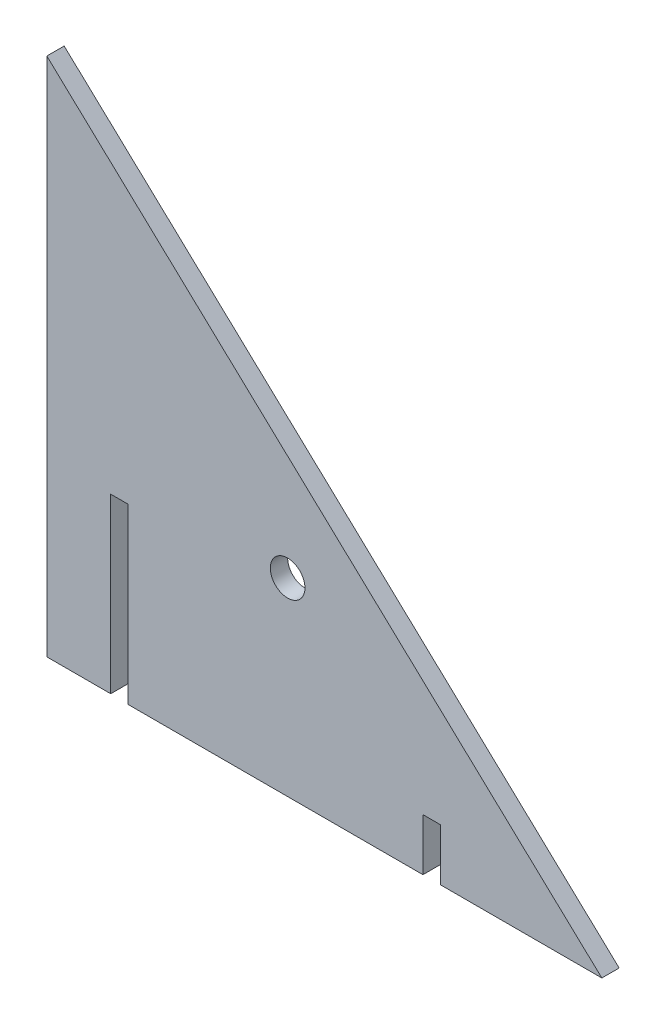
ISO-10303-21;
HEADER;
FILE_DESCRIPTION(('STEP AP214'),'2;1');
FILE_NAME('part.step','',(''),(''),'','','');
FILE_SCHEMA(('AUTOMOTIVE_DESIGN { 1 0 10303 214 1 1 1 1 }'));
ENDSEC;
DATA;
#1=APPLICATION_CONTEXT('core data for automotive mechanical design processes');
#2=APPLICATION_PROTOCOL_DEFINITION('international standard','automotive_design',2000,#1);
#3=PRODUCT_CONTEXT('',#1,'mechanical');
#4=PRODUCT('Part','Part','',(#3));
#5=PRODUCT_RELATED_PRODUCT_CATEGORY('part','',(#4));
#6=PRODUCT_DEFINITION_FORMATION('','',#4);
#7=PRODUCT_DEFINITION_CONTEXT('part definition',#1,'design');
#8=PRODUCT_DEFINITION('design','',#6,#7);
#9=PRODUCT_DEFINITION_SHAPE('','',#8);
#10=(LENGTH_UNIT() NAMED_UNIT(*) SI_UNIT(.MILLI.,.METRE.));
#11=(NAMED_UNIT(*) PLANE_ANGLE_UNIT() SI_UNIT($,.RADIAN.));
#12=(NAMED_UNIT(*) SI_UNIT($,.STERADIAN.) SOLID_ANGLE_UNIT());
#13=UNCERTAINTY_MEASURE_WITH_UNIT(LENGTH_MEASURE(1.E-05),#10,'distance_accuracy_value','');
#14=(GEOMETRIC_REPRESENTATION_CONTEXT(3) GLOBAL_UNCERTAINTY_ASSIGNED_CONTEXT((#13)) GLOBAL_UNIT_ASSIGNED_CONTEXT((#10,
#11,#12)) REPRESENTATION_CONTEXT('',''));
#15=CARTESIAN_POINT('',(0.,0.,0.));
#16=DIRECTION('',(0.,0.,1.));
#17=DIRECTION('',(1.,0.,0.));
#18=AXIS2_PLACEMENT_3D('',#15,#16,#17);
#19=CARTESIAN_POINT('',(0.,502.62579108452,76.2));
#20=DIRECTION('',(0.,1.,0.));
#21=DIRECTION('',(0.,0.,1.));
#22=AXIS2_PLACEMENT_3D('',#19,#20,#21);
#23=PLANE('',#22);
#24=DIRECTION('',(1.,0.,0.));
#25=VECTOR('',#24,1.);
#26=CARTESIAN_POINT('',(0.,502.62579108452,63.5));
#27=LINE('',#26,#25);
#28=CARTESIAN_POINT('',(2235.2,502.62579108452,63.5));
#29=VERTEX_POINT('',#28);
#30=CARTESIAN_POINT('',(2247.9,502.62579108452,63.5));
#31=VERTEX_POINT('',#30);
#32=EDGE_CURVE('E169',#29,#31,#27,.T.);
#33=ORIENTED_EDGE('',*,*,#32,.T.);
#34=DIRECTION('',(0.,0.,-1.));
#35=VECTOR('',#34,1.);
#36=CARTESIAN_POINT('',(2247.9,502.62579108452,76.2));
#37=LINE('',#36,#35);
#38=CARTESIAN_POINT('',(2247.9,502.62579108452,76.2));
#39=VERTEX_POINT('',#38);
#40=EDGE_CURVE('E151',#39,#31,#37,.T.);
#41=ORIENTED_EDGE('',*,*,#40,.F.);
#42=DIRECTION('',(1.,0.,0.));
#43=VECTOR('',#42,1.);
#44=CARTESIAN_POINT('',(0.,502.62579108452,76.2));
#45=LINE('',#44,#43);
#46=CARTESIAN_POINT('',(2235.2,502.62579108452,76.2));
#47=VERTEX_POINT('',#46);
#48=EDGE_CURVE('E197',#47,#39,#45,.T.);
#49=ORIENTED_EDGE('',*,*,#48,.F.);
#50=DIRECTION('',(0.,0.,-1.));
#51=VECTOR('',#50,1.);
#52=CARTESIAN_POINT('',(2235.2,502.62579108452,76.2));
#53=LINE('',#52,#51);
#54=EDGE_CURVE('E154',#47,#29,#53,.T.);
#55=ORIENTED_EDGE('',*,*,#54,.T.);
#56=EDGE_LOOP('',(#33,#41,#49,#55));
#57=FACE_BOUND('',#56,.T.);
#58=ADVANCED_FACE('F45',(#57),#23,.F.);
#59=CARTESIAN_POINT('',(2247.9,0.,76.2));
#60=DIRECTION('',(1.,0.,0.));
#61=DIRECTION('',(0.,0.,-1.));
#62=AXIS2_PLACEMENT_3D('',#59,#60,#61);
#63=PLANE('',#62);
#64=DIRECTION('',(0.,-1.,0.));
#65=VECTOR('',#64,1.);
#66=CARTESIAN_POINT('',(2247.9,0.,63.5));
#67=LINE('',#66,#65);
#68=CARTESIAN_POINT('',(2247.9,375.62579108452,63.5));
#69=VERTEX_POINT('',#68);
#70=EDGE_CURVE('E67',#31,#69,#67,.T.);
#71=ORIENTED_EDGE('',*,*,#70,.T.);
#72=DIRECTION('',(0.,0.,-1.));
#73=VECTOR('',#72,1.);
#74=CARTESIAN_POINT('',(2247.9,375.62579108452,76.2));
#75=LINE('',#74,#73);
#76=CARTESIAN_POINT('',(2247.9,375.62579108452,76.2));
#77=VERTEX_POINT('',#76);
#78=EDGE_CURVE('E148',#77,#69,#75,.T.);
#79=ORIENTED_EDGE('',*,*,#78,.F.);
#80=DIRECTION('',(0.,-1.,0.));
#81=VECTOR('',#80,1.);
#82=CARTESIAN_POINT('',(2247.9,0.,76.2));
#83=LINE('',#82,#81);
#84=EDGE_CURVE('E108',#39,#77,#83,.T.);
#85=ORIENTED_EDGE('',*,*,#84,.F.);
#86=ORIENTED_EDGE('',*,*,#40,.T.);
#87=EDGE_LOOP('',(#71,#79,#85,#86));
#88=FACE_BOUND('',#87,.T.);
#89=ADVANCED_FACE('F147',(#88),#63,.F.);
#90=CARTESIAN_POINT('',(0.,375.62579108452,76.2));
#91=DIRECTION('',(0.,1.,0.));
#92=DIRECTION('',(0.,0.,1.));
#93=AXIS2_PLACEMENT_3D('',#90,#91,#92);
#94=PLANE('',#93);
#95=DIRECTION('',(1.,0.,0.));
#96=VECTOR('',#95,1.);
#97=CARTESIAN_POINT('',(0.,375.62579108452,63.5));
#98=LINE('',#97,#96);
#99=CARTESIAN_POINT('',(2463.8,375.62579108452,63.5));
#100=VERTEX_POINT('',#99);
#101=EDGE_CURVE('E144',#69,#100,#98,.T.);
#102=ORIENTED_EDGE('',*,*,#101,.T.);
#103=DIRECTION('',(0.,0.,-1.));
#104=VECTOR('',#103,1.);
#105=CARTESIAN_POINT('',(2463.8,375.62579108452,76.2));
#106=LINE('',#105,#104);
#107=CARTESIAN_POINT('',(2463.8,375.62579108452,76.2));
#108=VERTEX_POINT('',#107);
#109=EDGE_CURVE('E233',#108,#100,#106,.T.);
#110=ORIENTED_EDGE('',*,*,#109,.F.);
#111=DIRECTION('',(1.,0.,0.));
#112=VECTOR('',#111,1.);
#113=CARTESIAN_POINT('',(0.,375.62579108452,76.2));
#114=LINE('',#113,#112);
#115=EDGE_CURVE('E157',#77,#108,#114,.T.);
#116=ORIENTED_EDGE('',*,*,#115,.F.);
#117=ORIENTED_EDGE('',*,*,#78,.T.);
#118=EDGE_LOOP('',(#102,#110,#116,#117));
#119=FACE_BOUND('',#118,.T.);
#120=ADVANCED_FACE('F156',(#119),#94,.F.);
#121=CARTESIAN_POINT('',(2463.8,0.,76.2));
#122=DIRECTION('',(-1.,0.,0.));
#123=DIRECTION('',(0.,0.,1.));
#124=AXIS2_PLACEMENT_3D('',#121,#122,#123);
#125=PLANE('',#124);
#126=DIRECTION('',(0.,1.,0.));
#127=VECTOR('',#126,1.);
#128=CARTESIAN_POINT('',(2463.8,0.,63.5));
#129=LINE('',#128,#127);
#130=CARTESIAN_POINT('',(2463.8,413.72579108452,63.5));
#131=VERTEX_POINT('',#130);
#132=EDGE_CURVE('E158',#100,#131,#129,.T.);
#133=ORIENTED_EDGE('',*,*,#132,.T.);
#134=DIRECTION('',(0.,0.,-1.));
#135=VECTOR('',#134,1.);
#136=CARTESIAN_POINT('',(2463.8,413.72579108452,76.2));
#137=LINE('',#136,#135);
#138=CARTESIAN_POINT('',(2463.8,413.72579108452,76.2));
#139=VERTEX_POINT('',#138);
#140=EDGE_CURVE('E231',#139,#131,#137,.T.);
#141=ORIENTED_EDGE('',*,*,#140,.F.);
#142=DIRECTION('',(0.,1.,0.));
#143=VECTOR('',#142,1.);
#144=CARTESIAN_POINT('',(2463.8,0.,76.2));
#145=LINE('',#144,#143);
#146=EDGE_CURVE('E193',#108,#139,#145,.T.);
#147=ORIENTED_EDGE('',*,*,#146,.F.);
#148=ORIENTED_EDGE('',*,*,#109,.T.);
#149=EDGE_LOOP('',(#133,#141,#147,#148));
#150=FACE_BOUND('',#149,.T.);
#151=ADVANCED_FACE('F270',(#150),#125,.F.);
#152=CARTESIAN_POINT('',(0.,413.72579108452,76.2));
#153=DIRECTION('',(0.,1.,0.));
#154=DIRECTION('',(0.,0.,1.));
#155=AXIS2_PLACEMENT_3D('',#152,#153,#154);
#156=PLANE('',#155);
#157=DIRECTION('',(1.,0.,0.));
#158=VECTOR('',#157,1.);
#159=CARTESIAN_POINT('',(0.,413.72579108452,63.5));
#160=LINE('',#159,#158);
#161=CARTESIAN_POINT('',(2476.5,413.72579108452,63.5));
#162=VERTEX_POINT('',#161);
#163=EDGE_CURVE('E232',#131,#162,#160,.T.);
#164=ORIENTED_EDGE('',*,*,#163,.T.);
#165=DIRECTION('',(0.,0.,-1.));
#166=VECTOR('',#165,1.);
#167=CARTESIAN_POINT('',(2476.5,413.72579108452,76.2));
#168=LINE('',#167,#166);
#169=CARTESIAN_POINT('',(2476.5,413.72579108452,76.2));
#170=VERTEX_POINT('',#169);
#171=EDGE_CURVE('E229',#170,#162,#168,.T.);
#172=ORIENTED_EDGE('',*,*,#171,.F.);
#173=DIRECTION('',(1.,0.,0.));
#174=VECTOR('',#173,1.);
#175=CARTESIAN_POINT('',(0.,413.72579108452,76.2));
#176=LINE('',#175,#174);
#177=EDGE_CURVE('E191',#139,#170,#176,.T.);
#178=ORIENTED_EDGE('',*,*,#177,.F.);
#179=ORIENTED_EDGE('',*,*,#140,.T.);
#180=EDGE_LOOP('',(#164,#172,#178,#179));
#181=FACE_BOUND('',#180,.T.);
#182=ADVANCED_FACE('F268',(#181),#156,.F.);
#183=CARTESIAN_POINT('',(2476.5,0.,76.2));
#184=DIRECTION('',(1.,0.,0.));
#185=DIRECTION('',(0.,0.,-1.));
#186=AXIS2_PLACEMENT_3D('',#183,#184,#185);
#187=PLANE('',#186);
#188=DIRECTION('',(0.,-1.,0.));
#189=VECTOR('',#188,1.);
#190=CARTESIAN_POINT('',(2476.5,0.,63.5));
#191=LINE('',#190,#189);
#192=CARTESIAN_POINT('',(2476.5,375.62579108452,63.5));
#193=VERTEX_POINT('',#192);
#194=EDGE_CURVE('E230',#162,#193,#191,.T.);
#195=ORIENTED_EDGE('',*,*,#194,.T.);
#196=DIRECTION('',(0.,0.,-1.));
#197=VECTOR('',#196,1.);
#198=CARTESIAN_POINT('',(2476.5,375.62579108452,76.2));
#199=LINE('',#198,#197);
#200=CARTESIAN_POINT('',(2476.5,375.62579108452,76.2));
#201=VERTEX_POINT('',#200);
#202=EDGE_CURVE('E187',#201,#193,#199,.T.);
#203=ORIENTED_EDGE('',*,*,#202,.F.);
#204=DIRECTION('',(0.,-1.,0.));
#205=VECTOR('',#204,1.);
#206=CARTESIAN_POINT('',(2476.5,0.,76.2));
#207=LINE('',#206,#205);
#208=EDGE_CURVE('E189',#170,#201,#207,.T.);
#209=ORIENTED_EDGE('',*,*,#208,.F.);
#210=ORIENTED_EDGE('',*,*,#171,.T.);
#211=EDGE_LOOP('',(#195,#203,#209,#210));
#212=FACE_BOUND('',#211,.T.);
#213=ADVANCED_FACE('F265',(#212),#187,.F.);
#214=CARTESIAN_POINT('',(0.,375.62579108452,76.2));
#215=DIRECTION('',(0.,1.,0.));
#216=DIRECTION('',(0.,0.,1.));
#217=AXIS2_PLACEMENT_3D('',#214,#215,#216);
#218=PLANE('',#217);
#219=DIRECTION('',(1.,0.,0.));
#220=VECTOR('',#219,1.);
#221=CARTESIAN_POINT('',(0.,375.62579108452,63.5));
#222=LINE('',#221,#220);
#223=CARTESIAN_POINT('',(2594.80543184624,375.62579108452,63.5));
#224=VERTEX_POINT('',#223);
#225=EDGE_CURVE('E226',#193,#224,#222,.T.);
#226=ORIENTED_EDGE('',*,*,#225,.T.);
#227=DIRECTION('',(0.,0.,-1.));
#228=VECTOR('',#227,1.);
#229=CARTESIAN_POINT('',(2594.80543184624,375.62579108452,76.2));
#230=LINE('',#229,#228);
#231=CARTESIAN_POINT('',(2594.80543184624,375.62579108452,76.2));
#232=VERTEX_POINT('',#231);
#233=EDGE_CURVE('E186',#232,#224,#230,.T.);
#234=ORIENTED_EDGE('',*,*,#233,.F.);
#235=DIRECTION('',(1.,0.,0.));
#236=VECTOR('',#235,1.);
#237=CARTESIAN_POINT('',(0.,375.62579108452,76.2));
#238=LINE('',#237,#236);
#239=EDGE_CURVE('E181',#201,#232,#238,.T.);
#240=ORIENTED_EDGE('',*,*,#239,.F.);
#241=ORIENTED_EDGE('',*,*,#202,.T.);
#242=EDGE_LOOP('',(#226,#234,#240,#241));
#243=FACE_BOUND('',#242,.T.);
#244=ADVANCED_FACE('F261',(#243),#218,.F.);
#245=CARTESIAN_POINT('',(1402.6919680833,1494.50400839036,76.2));
#246=DIRECTION('',(0.684355044859281,0.729148937169665,0.));
#247=DIRECTION('',(-0.729148937169665,0.684355044859281,0.));
#248=AXIS2_PLACEMENT_3D('',#245,#246,#247);
#249=PLANE('',#248);
#250=DIRECTION('',(0.729148937169665,-0.684355044859281,0.));
#251=VECTOR('',#250,1.);
#252=CARTESIAN_POINT('',(1402.6919680833,1494.50400839036,63.5));
#253=LINE('',#252,#251);
#254=CARTESIAN_POINT('',(2188.40543184624,757.059372144649,63.5));
#255=VERTEX_POINT('',#254);
#256=EDGE_CURVE('E56',#255,#224,#253,.T.);
#257=ORIENTED_EDGE('',*,*,#256,.F.);
#258=DIRECTION('',(0.,0.,-1.));
#259=VECTOR('',#258,1.);
#260=CARTESIAN_POINT('',(2188.40543184624,757.059372144649,76.2));
#261=LINE('',#260,#259);
#262=CARTESIAN_POINT('',(2188.40543184624,757.059372144649,76.2));
#263=VERTEX_POINT('',#262);
#264=EDGE_CURVE('E219',#263,#255,#261,.T.);
#265=ORIENTED_EDGE('',*,*,#264,.F.);
#266=DIRECTION('',(0.729148937169665,-0.684355044859281,0.));
#267=VECTOR('',#266,1.);
#268=CARTESIAN_POINT('',(1402.6919680833,1494.50400839036,76.2));
#269=LINE('',#268,#267);
#270=EDGE_CURVE('E182',#263,#232,#269,.T.);
#271=ORIENTED_EDGE('',*,*,#270,.T.);
#272=ORIENTED_EDGE('',*,*,#233,.T.);
#273=EDGE_LOOP('',(#257,#265,#271,#272));
#274=FACE_BOUND('',#273,.T.);
#275=ADVANCED_FACE('F257',(#274),#249,.T.);
#276=CARTESIAN_POINT('',(2188.40543184624,0.,76.2));
#277=DIRECTION('',(1.,0.,0.));
#278=DIRECTION('',(0.,0.,-1.));
#279=AXIS2_PLACEMENT_3D('',#276,#277,#278);
#280=PLANE('',#279);
#281=DIRECTION('',(0.,-1.,0.));
#282=VECTOR('',#281,1.);
#283=CARTESIAN_POINT('',(2188.40543184624,0.,63.5));
#284=LINE('',#283,#282);
#285=CARTESIAN_POINT('',(2188.40543184624,376.059372144649,63.5));
#286=VERTEX_POINT('',#285);
#287=EDGE_CURVE('E220',#255,#286,#284,.T.);
#288=ORIENTED_EDGE('',*,*,#287,.T.);
#289=DIRECTION('',(0.,0.,-1.));
#290=VECTOR('',#289,1.);
#291=CARTESIAN_POINT('',(2188.40543184624,376.059372144649,76.2));
#292=LINE('',#291,#290);
#293=CARTESIAN_POINT('',(2188.40543184624,376.059372144649,76.2));
#294=VERTEX_POINT('',#293);
#295=EDGE_CURVE('E210',#294,#286,#292,.T.);
#296=ORIENTED_EDGE('',*,*,#295,.F.);
#297=DIRECTION('',(0.,-1.,0.));
#298=VECTOR('',#297,1.);
#299=CARTESIAN_POINT('',(2188.40543184624,0.,76.2));
#300=LINE('',#299,#298);
#301=EDGE_CURVE('E178',#263,#294,#300,.T.);
#302=ORIENTED_EDGE('',*,*,#301,.F.);
#303=ORIENTED_EDGE('',*,*,#264,.T.);
#304=EDGE_LOOP('',(#288,#296,#302,#303));
#305=FACE_BOUND('',#304,.T.);
#306=ADVANCED_FACE('F249',(#305),#280,.F.);
#307=CARTESIAN_POINT('',(0.,376.059372144649,76.2));
#308=DIRECTION('',(0.,1.,0.));
#309=DIRECTION('',(0.,0.,1.));
#310=AXIS2_PLACEMENT_3D('',#307,#308,#309);
#311=PLANE('',#310);
#312=DIRECTION('',(1.,0.,0.));
#313=VECTOR('',#312,1.);
#314=CARTESIAN_POINT('',(0.,376.059372144649,63.5));
#315=LINE('',#314,#313);
#316=CARTESIAN_POINT('',(2235.2,376.059372144649,63.5));
#317=VERTEX_POINT('',#316);
#318=EDGE_CURVE('E216',#286,#317,#315,.T.);
#319=ORIENTED_EDGE('',*,*,#318,.T.);
#320=DIRECTION('',(0.,0.,-1.));
#321=VECTOR('',#320,1.);
#322=CARTESIAN_POINT('',(2235.2,376.059372144649,76.2));
#323=LINE('',#322,#321);
#324=CARTESIAN_POINT('',(2235.2,376.059372144649,76.2));
#325=VERTEX_POINT('',#324);
#326=EDGE_CURVE('E204',#325,#317,#323,.T.);
#327=ORIENTED_EDGE('',*,*,#326,.F.);
#328=DIRECTION('',(1.,0.,0.));
#329=VECTOR('',#328,1.);
#330=CARTESIAN_POINT('',(0.,376.059372144649,76.2));
#331=LINE('',#330,#329);
#332=EDGE_CURVE('E175',#294,#325,#331,.T.);
#333=ORIENTED_EDGE('',*,*,#332,.F.);
#334=ORIENTED_EDGE('',*,*,#295,.T.);
#335=EDGE_LOOP('',(#319,#327,#333,#334));
#336=FACE_BOUND('',#335,.T.);
#337=ADVANCED_FACE('F289',(#336),#311,.F.);
#338=CARTESIAN_POINT('',(2235.2,0.,76.2));
#339=DIRECTION('',(-1.,0.,0.));
#340=DIRECTION('',(0.,0.,1.));
#341=AXIS2_PLACEMENT_3D('',#338,#339,#340);
#342=PLANE('',#341);
#343=DIRECTION('',(0.,1.,0.));
#344=VECTOR('',#343,1.);
#345=CARTESIAN_POINT('',(2235.2,0.,63.5));
#346=LINE('',#345,#344);
#347=EDGE_CURVE('E118',#317,#29,#346,.T.);
#348=ORIENTED_EDGE('',*,*,#347,.T.);
#349=ORIENTED_EDGE('',*,*,#54,.F.);
#350=DIRECTION('',(0.,1.,0.));
#351=VECTOR('',#350,1.);
#352=CARTESIAN_POINT('',(2235.2,0.,76.2));
#353=LINE('',#352,#351);
#354=EDGE_CURVE('E172',#325,#47,#353,.T.);
#355=ORIENTED_EDGE('',*,*,#354,.F.);
#356=ORIENTED_EDGE('',*,*,#326,.T.);
#357=EDGE_LOOP('',(#348,#349,#355,#356));
#358=FACE_BOUND('',#357,.T.);
#359=ADVANCED_FACE('F286',(#358),#342,.F.);
#360=CARTESIAN_POINT('',(0.,0.,76.2));
#361=DIRECTION('',(0.,0.,1.));
#362=DIRECTION('',(1.,0.,0.));
#363=AXIS2_PLACEMENT_3D('',#360,#361,#362);
#364=PLANE('',#363);
#365=CARTESIAN_POINT('',(2364.73313789473,514.219766290025,76.2));
#366=DIRECTION('',(0.,0.,1.));
#367=DIRECTION('',(1.,0.,0.));
#368=AXIS2_PLACEMENT_3D('',#365,#366,#367);
#369=CIRCLE('',#368,12.6999999999999);
#370=CARTESIAN_POINT('',(2377.43313789473,514.219766290025,76.2));
#371=VERTEX_POINT('',#370);
#372=EDGE_CURVE('E49',#371,#371,#369,.F.);
#373=ORIENTED_EDGE('',*,*,#372,.T.);
#374=EDGE_LOOP('',(#373));
#375=FACE_BOUND('',#374,.T.);
#376=ORIENTED_EDGE('',*,*,#48,.T.);
#377=ORIENTED_EDGE('',*,*,#84,.T.);
#378=ORIENTED_EDGE('',*,*,#115,.T.);
#379=ORIENTED_EDGE('',*,*,#146,.T.);
#380=ORIENTED_EDGE('',*,*,#177,.T.);
#381=ORIENTED_EDGE('',*,*,#208,.T.);
#382=ORIENTED_EDGE('',*,*,#239,.T.);
#383=ORIENTED_EDGE('',*,*,#270,.F.);
#384=ORIENTED_EDGE('',*,*,#301,.T.);
#385=ORIENTED_EDGE('',*,*,#332,.T.);
#386=ORIENTED_EDGE('',*,*,#354,.T.);
#387=EDGE_LOOP('',(#376,#377,#378,#379,#380,#381,#382,#383,#384,#385,#386));
#388=FACE_BOUND('',#387,.T.);
#389=ADVANCED_FACE('F47',(#375,#388),#364,.T.);
#390=CARTESIAN_POINT('',(0.,0.,63.5));
#391=DIRECTION('',(0.,0.,1.));
#392=DIRECTION('',(1.,0.,0.));
#393=AXIS2_PLACEMENT_3D('',#390,#391,#392);
#394=PLANE('',#393);
#395=CARTESIAN_POINT('',(2364.73313789473,514.219766290025,63.5));
#396=DIRECTION('',(0.,0.,1.));
#397=DIRECTION('',(1.,0.,0.));
#398=AXIS2_PLACEMENT_3D('',#395,#396,#397);
#399=CIRCLE('',#398,12.6999999999999);
#400=CARTESIAN_POINT('',(2377.43313789473,514.219766290025,63.4999999999999));
#401=VERTEX_POINT('',#400);
#402=EDGE_CURVE('E11',#401,#401,#399,.F.);
#403=ORIENTED_EDGE('',*,*,#402,.F.);
#404=EDGE_LOOP('',(#403));
#405=FACE_BOUND('',#404,.T.);
#406=ORIENTED_EDGE('',*,*,#32,.F.);
#407=ORIENTED_EDGE('',*,*,#347,.F.);
#408=ORIENTED_EDGE('',*,*,#318,.F.);
#409=ORIENTED_EDGE('',*,*,#287,.F.);
#410=ORIENTED_EDGE('',*,*,#256,.T.);
#411=ORIENTED_EDGE('',*,*,#225,.F.);
#412=ORIENTED_EDGE('',*,*,#194,.F.);
#413=ORIENTED_EDGE('',*,*,#163,.F.);
#414=ORIENTED_EDGE('',*,*,#132,.F.);
#415=ORIENTED_EDGE('',*,*,#101,.F.);
#416=ORIENTED_EDGE('',*,*,#70,.F.);
#417=EDGE_LOOP('',(#406,#407,#408,#409,#410,#411,#412,#413,#414,#415,#416));
#418=FACE_BOUND('',#417,.T.);
#419=ADVANCED_FACE('F161',(#405,#418),#394,.F.);
#420=CARTESIAN_POINT('',(2364.73313789473,514.219766290026,-224.530173537895));
#421=DIRECTION('',(0.,0.,1.));
#422=DIRECTION('',(1.,0.,0.));
#423=AXIS2_PLACEMENT_3D('',#420,#421,#422);
#424=CYLINDRICAL_SURFACE('',#423,12.6999999999999);
#425=CARTESIAN_POINT('',(2377.43313789473,514.219766290025,76.2));
#426=CARTESIAN_POINT('',(2377.43313789473,514.219766290025,76.0677083333333));
#427=CARTESIAN_POINT('',(2377.43313789473,514.219766290025,75.9354166666666));
#428=CARTESIAN_POINT('',(2377.43313789473,514.219766290025,75.6708333333333));
#429=CARTESIAN_POINT('',(2377.43313789473,514.219766290025,75.5385416666667));
#430=CARTESIAN_POINT('',(2377.43313789473,514.219766290025,75.2739583333333));
#431=CARTESIAN_POINT('',(2377.43313789473,514.219766290025,75.1416666666667));
#432=CARTESIAN_POINT('',(2377.43313789473,514.219766290025,74.8770833333333));
#433=CARTESIAN_POINT('',(2377.43313789473,514.219766290025,74.7447916666666));
#434=CARTESIAN_POINT('',(2377.43313789473,514.219766290025,74.4802083333333));
#435=CARTESIAN_POINT('',(2377.43313789473,514.219766290025,74.3479166666667));
#436=CARTESIAN_POINT('',(2377.43313789473,514.219766290025,74.0833333333333));
#437=CARTESIAN_POINT('',(2377.43313789473,514.219766290025,73.9510416666667));
#438=CARTESIAN_POINT('',(2377.43313789473,514.219766290025,73.6864583333333));
#439=CARTESIAN_POINT('',(2377.43313789473,514.219766290025,73.5541666666666));
#440=CARTESIAN_POINT('',(2377.43313789473,514.219766290025,73.2895833333333));
#441=CARTESIAN_POINT('',(2377.43313789473,514.219766290025,73.1572916666666));
#442=CARTESIAN_POINT('',(2377.43313789473,514.219766290025,72.8927083333333));
#443=CARTESIAN_POINT('',(2377.43313789473,514.219766290025,72.7604166666666));
#444=CARTESIAN_POINT('',(2377.43313789473,514.219766290025,72.4958333333333));
#445=CARTESIAN_POINT('',(2377.43313789473,514.219766290025,72.3635416666666));
#446=CARTESIAN_POINT('',(2377.43313789473,514.219766290025,72.0989583333333));
#447=CARTESIAN_POINT('',(2377.43313789473,514.219766290025,71.9666666666666));
#448=CARTESIAN_POINT('',(2377.43313789473,514.219766290025,71.7020833333333));
#449=CARTESIAN_POINT('',(2377.43313789473,514.219766290025,71.5697916666666));
#450=CARTESIAN_POINT('',(2377.43313789473,514.219766290025,71.3052083333333));
#451=CARTESIAN_POINT('',(2377.43313789473,514.219766290025,71.1729166666666));
#452=CARTESIAN_POINT('',(2377.43313789473,514.219766290025,70.9083333333333));
#453=CARTESIAN_POINT('',(2377.43313789473,514.219766290025,70.7760416666666));
#454=CARTESIAN_POINT('',(2377.43313789473,514.219766290025,70.5114583333333));
#455=CARTESIAN_POINT('',(2377.43313789473,514.219766290025,70.3791666666666));
#456=CARTESIAN_POINT('',(2377.43313789473,514.219766290025,70.1145833333333));
#457=CARTESIAN_POINT('',(2377.43313789473,514.219766290025,69.9822916666666));
#458=CARTESIAN_POINT('',(2377.43313789473,514.219766290025,69.7177083333333));
#459=CARTESIAN_POINT('',(2377.43313789473,514.219766290025,69.5854166666666));
#460=CARTESIAN_POINT('',(2377.43313789473,514.219766290025,69.3208333333333));
#461=CARTESIAN_POINT('',(2377.43313789473,514.219766290025,69.1885416666667));
#462=CARTESIAN_POINT('',(2377.43313789473,514.219766290025,68.9239583333333));
#463=CARTESIAN_POINT('',(2377.43313789473,514.219766290025,68.7916666666666));
#464=CARTESIAN_POINT('',(2377.43313789473,514.219766290025,68.5270833333333));
#465=CARTESIAN_POINT('',(2377.43313789473,514.219766290025,68.3947916666666));
#466=CARTESIAN_POINT('',(2377.43313789473,514.219766290025,68.1302083333333));
#467=CARTESIAN_POINT('',(2377.43313789473,514.219766290025,67.9979166666666));
#468=CARTESIAN_POINT('',(2377.43313789473,514.219766290025,67.7333333333333));
#469=CARTESIAN_POINT('',(2377.43313789473,514.219766290025,67.6010416666666));
#470=CARTESIAN_POINT('',(2377.43313789473,514.219766290025,67.3364583333333));
#471=CARTESIAN_POINT('',(2377.43313789473,514.219766290025,67.2041666666666));
#472=CARTESIAN_POINT('',(2377.43313789473,514.219766290025,66.9395833333333));
#473=CARTESIAN_POINT('',(2377.43313789473,514.219766290025,66.8072916666666));
#474=CARTESIAN_POINT('',(2377.43313789473,514.219766290025,66.5427083333333));
#475=CARTESIAN_POINT('',(2377.43313789473,514.219766290025,66.4104166666666));
#476=CARTESIAN_POINT('',(2377.43313789473,514.219766290025,66.1458333333333));
#477=CARTESIAN_POINT('',(2377.43313789473,514.219766290025,66.0135416666666));
#478=CARTESIAN_POINT('',(2377.43313789473,514.219766290025,65.7489583333333));
#479=CARTESIAN_POINT('',(2377.43313789473,514.219766290025,65.6166666666666));
#480=CARTESIAN_POINT('',(2377.43313789473,514.219766290025,65.3520833333333));
#481=CARTESIAN_POINT('',(2377.43313789473,514.219766290025,65.2197916666666));
#482=CARTESIAN_POINT('',(2377.43313789473,514.219766290025,64.9552083333333));
#483=CARTESIAN_POINT('',(2377.43313789473,514.219766290025,64.8229166666666));
#484=CARTESIAN_POINT('',(2377.43313789473,514.219766290025,64.5583333333333));
#485=CARTESIAN_POINT('',(2377.43313789473,514.219766290025,64.4260416666666));
#486=CARTESIAN_POINT('',(2377.43313789473,514.219766290025,64.1614583333333));
#487=CARTESIAN_POINT('',(2377.43313789473,514.219766290025,64.0291666666666));
#488=CARTESIAN_POINT('',(2377.43313789473,514.219766290025,63.7645833333333));
#489=CARTESIAN_POINT('',(2377.43313789473,514.219766290025,63.6322916666666));
#490=CARTESIAN_POINT('',(2377.43313789473,514.219766290025,63.4999999999999));
#491=B_SPLINE_CURVE_WITH_KNOTS('',3,(#425,#426,#427,#428,#429,#430,#431,#432,#433,#434,#435,
#436,#437,#438,#439,#440,#441,#442,#443,#444,#445,#446,#447,#448,#449,#450,#451,#452,#453,#454,
#455,#456,#457,#458,#459,#460,#461,#462,#463,#464,#465,#466,#467,#468,#469,#470,#471,#472,#473,
#474,#475,#476,#477,#478,#479,#480,#481,#482,#483,#484,#485,#486,#487,#488,#489,#490),
.UNSPECIFIED.,.F.,.F.,(4,2,2,2,2,2,2,2,2,2,2,2,2,2,2,2,2,2,2,2,2,2,2,2,2,2,2,2,2,2,2,2,4),(0.,
0.396875000000019,0.793749999999982,1.190625,1.58750000000002,1.98437499999998,2.38125,
2.77812500000002,3.17500000000004,3.571875,3.96875000000002,4.36562500000004,4.7625,
5.15937500000002,5.55625000000004,5.953125,6.35000000000002,6.74687500000004,7.14375,
7.54062500000002,7.93750000000004,8.334375,8.73125000000002,9.12812500000004,9.52500000000001,
9.92187500000002,10.31875,10.7156250000001,11.1125,11.509375,11.9062500000001,12.303125,12.7),.UNSPECIFIED.);
#492=EDGE_CURVE('BSEAM301',#371,#401,#491,.T.);
#493=ORIENTED_EDGE('',*,*,#372,.F.);
#494=ORIENTED_EDGE('',*,*,#402,.T.);
#495=ORIENTED_EDGE('',*,*,#492,.T.);
#496=ORIENTED_EDGE('',*,*,#492,.F.);
#497=EDGE_LOOP('',(#493,#495,#494,#496));
#498=FACE_BOUND('',#497,.T.);
#499=ADVANCED_FACE('F301',(#498),#424,.F.);
#500=CLOSED_SHELL('',(#58,#89,#120,#151,#182,#213,#244,#275,#306,#337,#359,#389,#419,#499));
#501=MANIFOLD_SOLID_BREP('B2',#500);
#502=ADVANCED_BREP_SHAPE_REPRESENTATION('',(#18,#501),#14);
#503=SHAPE_DEFINITION_REPRESENTATION(#9,#502);
ENDSEC;
END-ISO-10303-21;
